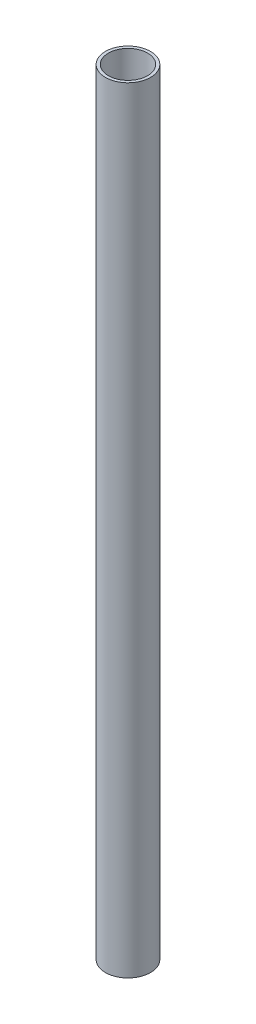
ISO-10303-21;
HEADER;
FILE_DESCRIPTION(('STEP AP214'),'2;1');
FILE_NAME('part.step','',(''),(''),'','','');
FILE_SCHEMA(('AUTOMOTIVE_DESIGN { 1 0 10303 214 1 1 1 1 }'));
ENDSEC;
DATA;
#1=APPLICATION_CONTEXT('core data for automotive mechanical design processes');
#2=APPLICATION_PROTOCOL_DEFINITION('international standard','automotive_design',2000,#1);
#3=PRODUCT_CONTEXT('',#1,'mechanical');
#4=PRODUCT('Part','Part','',(#3));
#5=PRODUCT_RELATED_PRODUCT_CATEGORY('part','',(#4));
#6=PRODUCT_DEFINITION_FORMATION('','',#4);
#7=PRODUCT_DEFINITION_CONTEXT('part definition',#1,'design');
#8=PRODUCT_DEFINITION('design','',#6,#7);
#9=PRODUCT_DEFINITION_SHAPE('','',#8);
#10=(LENGTH_UNIT() NAMED_UNIT(*) SI_UNIT(.MILLI.,.METRE.));
#11=(NAMED_UNIT(*) PLANE_ANGLE_UNIT() SI_UNIT($,.RADIAN.));
#12=(NAMED_UNIT(*) SI_UNIT($,.STERADIAN.) SOLID_ANGLE_UNIT());
#13=UNCERTAINTY_MEASURE_WITH_UNIT(LENGTH_MEASURE(1.E-05),#10,'distance_accuracy_value','');
#14=(GEOMETRIC_REPRESENTATION_CONTEXT(3) GLOBAL_UNCERTAINTY_ASSIGNED_CONTEXT((#13)) GLOBAL_UNIT_ASSIGNED_CONTEXT((#10,
#11,#12)) REPRESENTATION_CONTEXT('',''));
#15=CARTESIAN_POINT('',(0.,0.,0.));
#16=DIRECTION('',(0.,0.,1.));
#17=DIRECTION('',(1.,0.,0.));
#18=AXIS2_PLACEMENT_3D('',#15,#16,#17);
#19=CARTESIAN_POINT('',(0.,203.2,0.));
#20=DIRECTION('',(0.,1.,0.));
#21=DIRECTION('',(0.,0.,1.));
#22=AXIS2_PLACEMENT_3D('',#19,#20,#21);
#23=PLANE('',#22);
#24=CARTESIAN_POINT('',(0.,203.2,0.));
#25=DIRECTION('',(0.,1.,0.));
#26=DIRECTION('',(0.,0.,1.));
#27=AXIS2_PLACEMENT_3D('',#24,#25,#26);
#28=CIRCLE('',#27,5.9055);
#29=CARTESIAN_POINT('',(0.,203.2,5.9055));
#30=VERTEX_POINT('',#29);
#31=EDGE_CURVE('E10',#30,#30,#28,.T.);
#32=ORIENTED_EDGE('',*,*,#31,.T.);
#33=EDGE_LOOP('',(#32));
#34=FACE_BOUND('',#33,.T.);
#35=CARTESIAN_POINT('',(0.,203.2,0.));
#36=DIRECTION('',(0.,1.,0.));
#37=DIRECTION('',(0.,0.,1.));
#38=AXIS2_PLACEMENT_3D('',#35,#36,#37);
#39=CIRCLE('',#38,5.1435);
#40=CARTESIAN_POINT('',(0.,203.2,5.1435));
#41=VERTEX_POINT('',#40);
#42=EDGE_CURVE('E42',#41,#41,#39,.T.);
#43=ORIENTED_EDGE('',*,*,#42,.F.);
#44=EDGE_LOOP('',(#43));
#45=FACE_BOUND('',#44,.T.);
#46=ADVANCED_FACE('F31',(#34,#45),#23,.T.);
#47=CARTESIAN_POINT('',(0.,0.,0.));
#48=DIRECTION('',(0.,1.,0.));
#49=DIRECTION('',(0.,0.,1.));
#50=AXIS2_PLACEMENT_3D('',#47,#48,#49);
#51=PLANE('',#50);
#52=CARTESIAN_POINT('',(0.,0.,0.));
#53=DIRECTION('',(0.,1.,0.));
#54=DIRECTION('',(0.,0.,1.));
#55=AXIS2_PLACEMENT_3D('',#52,#53,#54);
#56=CIRCLE('',#55,5.9055);
#57=CARTESIAN_POINT('',(0.,0.,5.9055));
#58=VERTEX_POINT('',#57);
#59=EDGE_CURVE('E35',#58,#58,#56,.T.);
#60=ORIENTED_EDGE('',*,*,#59,.F.);
#61=EDGE_LOOP('',(#60));
#62=FACE_BOUND('',#61,.T.);
#63=CARTESIAN_POINT('',(0.,0.,0.));
#64=DIRECTION('',(0.,1.,0.));
#65=DIRECTION('',(0.,0.,1.));
#66=AXIS2_PLACEMENT_3D('',#63,#64,#65);
#67=CIRCLE('',#66,5.1435);
#68=CARTESIAN_POINT('',(0.,0.,5.1435));
#69=VERTEX_POINT('',#68);
#70=EDGE_CURVE('E44',#69,#69,#67,.T.);
#71=ORIENTED_EDGE('',*,*,#70,.T.);
#72=EDGE_LOOP('',(#71));
#73=FACE_BOUND('',#72,.T.);
#74=ADVANCED_FACE('F54',(#62,#73),#51,.F.);
#75=CARTESIAN_POINT('',(0.,203.2,0.));
#76=DIRECTION('',(0.,-1.,0.));
#77=DIRECTION('',(0.,0.,-1.));
#78=AXIS2_PLACEMENT_3D('',#75,#76,#77);
#79=CYLINDRICAL_SURFACE('',#78,5.9055);
#80=ORIENTED_EDGE('',*,*,#31,.F.);
#81=EDGE_LOOP('',(#80));
#82=FACE_BOUND('',#81,.T.);
#83=ORIENTED_EDGE('',*,*,#59,.T.);
#84=EDGE_LOOP('',(#83));
#85=FACE_BOUND('',#84,.T.);
#86=ADVANCED_FACE('F33',(#82,#85),#79,.T.);
#87=CARTESIAN_POINT('',(0.,203.2,0.));
#88=DIRECTION('',(0.,-1.,0.));
#89=DIRECTION('',(0.,0.,-1.));
#90=AXIS2_PLACEMENT_3D('',#87,#88,#89);
#91=CYLINDRICAL_SURFACE('',#90,5.1435);
#92=ORIENTED_EDGE('',*,*,#42,.T.);
#93=EDGE_LOOP('',(#92));
#94=FACE_BOUND('',#93,.T.);
#95=ORIENTED_EDGE('',*,*,#70,.F.);
#96=EDGE_LOOP('',(#95));
#97=FACE_BOUND('',#96,.T.);
#98=ADVANCED_FACE('F50',(#94,#97),#91,.F.);
#99=CLOSED_SHELL('',(#46,#74,#86,#98));
#100=MANIFOLD_SOLID_BREP('B2',#99);
#101=ADVANCED_BREP_SHAPE_REPRESENTATION('',(#18,#100),#14);
#102=SHAPE_DEFINITION_REPRESENTATION(#9,#101);
ENDSEC;
END-ISO-10303-21;
